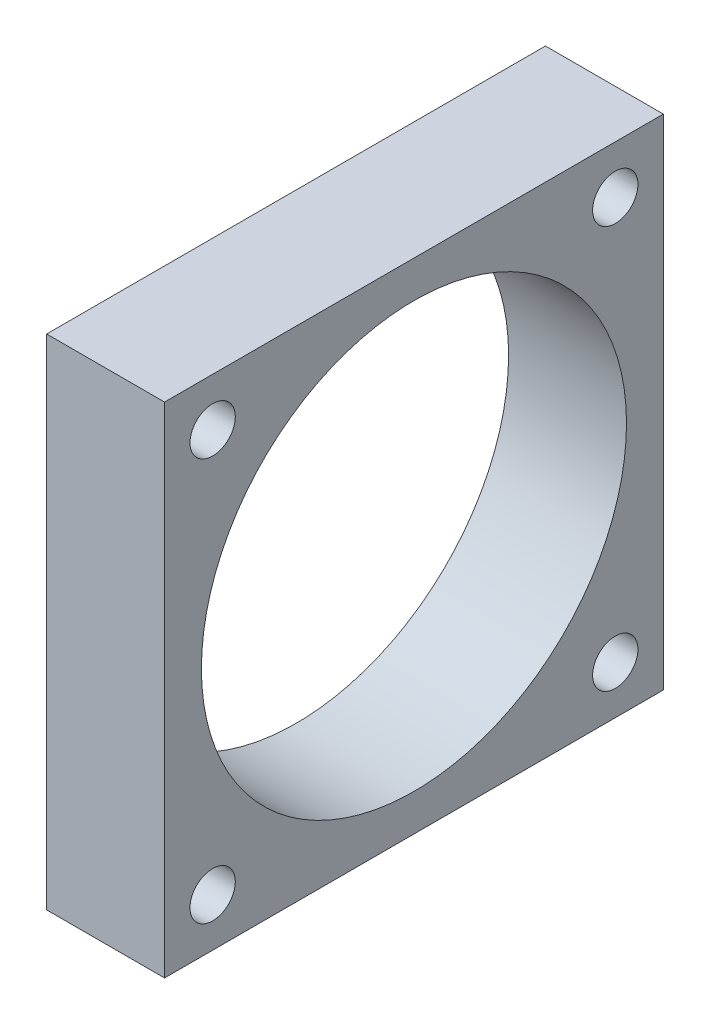
ISO-10303-21;
HEADER;
FILE_DESCRIPTION(('STEP AP214'),'2;1');
FILE_NAME('part.step','',(''),(''),'','','');
FILE_SCHEMA(('AUTOMOTIVE_DESIGN { 1 0 10303 214 1 1 1 1 }'));
ENDSEC;
DATA;
#1=APPLICATION_CONTEXT('core data for automotive mechanical design processes');
#2=APPLICATION_PROTOCOL_DEFINITION('international standard','automotive_design',2000,#1);
#3=PRODUCT_CONTEXT('',#1,'mechanical');
#4=PRODUCT('Part','Part','',(#3));
#5=PRODUCT_RELATED_PRODUCT_CATEGORY('part','',(#4));
#6=PRODUCT_DEFINITION_FORMATION('','',#4);
#7=PRODUCT_DEFINITION_CONTEXT('part definition',#1,'design');
#8=PRODUCT_DEFINITION('design','',#6,#7);
#9=PRODUCT_DEFINITION_SHAPE('','',#8);
#10=(LENGTH_UNIT() NAMED_UNIT(*) SI_UNIT(.MILLI.,.METRE.));
#11=(NAMED_UNIT(*) PLANE_ANGLE_UNIT() SI_UNIT($,.RADIAN.));
#12=(NAMED_UNIT(*) SI_UNIT($,.STERADIAN.) SOLID_ANGLE_UNIT());
#13=UNCERTAINTY_MEASURE_WITH_UNIT(LENGTH_MEASURE(1.E-05),#10,'distance_accuracy_value','');
#14=(GEOMETRIC_REPRESENTATION_CONTEXT(3) GLOBAL_UNCERTAINTY_ASSIGNED_CONTEXT((#13)) GLOBAL_UNIT_ASSIGNED_CONTEXT((#10,
#11,#12)) REPRESENTATION_CONTEXT('',''));
#15=CARTESIAN_POINT('',(0.,0.,0.));
#16=DIRECTION('',(0.,0.,1.));
#17=DIRECTION('',(1.,0.,0.));
#18=AXIS2_PLACEMENT_3D('',#15,#16,#17);
#19=CARTESIAN_POINT('',(13.208,0.,0.));
#20=DIRECTION('',(1.,0.,0.));
#21=DIRECTION('',(0.,0.,-1.));
#22=AXIS2_PLACEMENT_3D('',#19,#20,#21);
#23=PLANE('',#22);
#24=CARTESIAN_POINT('',(13.208,-22.5518463273584,-22.5518463273586));
#25=DIRECTION('',(1.,0.,0.));
#26=DIRECTION('',(0.,0.,-1.));
#27=AXIS2_PLACEMENT_3D('',#24,#25,#26);
#28=CIRCLE('',#27,2.54);
#29=CARTESIAN_POINT('',(13.208,-22.5518463273584,-25.0918463273586));
#30=VERTEX_POINT('',#29);
#31=EDGE_CURVE('E133',#30,#30,#28,.T.);
#32=ORIENTED_EDGE('',*,*,#31,.F.);
#33=EDGE_LOOP('',(#32));
#34=FACE_BOUND('',#33,.T.);
#35=CARTESIAN_POINT('',(13.208,22.5518463273586,-22.5518463273584));
#36=DIRECTION('',(1.,0.,0.));
#37=DIRECTION('',(0.,0.,-1.));
#38=AXIS2_PLACEMENT_3D('',#35,#36,#37);
#39=CIRCLE('',#38,2.54);
#40=CARTESIAN_POINT('',(13.208,22.5518463273586,-25.0918463273584));
#41=VERTEX_POINT('',#40);
#42=EDGE_CURVE('E136',#41,#41,#39,.T.);
#43=ORIENTED_EDGE('',*,*,#42,.F.);
#44=EDGE_LOOP('',(#43));
#45=FACE_BOUND('',#44,.T.);
#46=CARTESIAN_POINT('',(13.208,22.5518463273584,22.5518463273586));
#47=DIRECTION('',(1.,0.,0.));
#48=DIRECTION('',(0.,0.,-1.));
#49=AXIS2_PLACEMENT_3D('',#46,#47,#48);
#50=CIRCLE('',#49,2.54);
#51=CARTESIAN_POINT('',(13.208,22.5518463273584,20.0118463273586));
#52=VERTEX_POINT('',#51);
#53=EDGE_CURVE('E132',#52,#52,#50,.T.);
#54=ORIENTED_EDGE('',*,*,#53,.F.);
#55=EDGE_LOOP('',(#54));
#56=FACE_BOUND('',#55,.T.);
#57=CARTESIAN_POINT('',(13.208,-22.5518463273586,22.5518463273584));
#58=DIRECTION('',(1.,0.,0.));
#59=DIRECTION('',(0.,0.,-1.));
#60=AXIS2_PLACEMENT_3D('',#57,#58,#59);
#61=CIRCLE('',#60,2.54);
#62=CARTESIAN_POINT('',(13.208,-22.5518463273586,20.0118463273584));
#63=VERTEX_POINT('',#62);
#64=EDGE_CURVE('E113',#63,#63,#61,.T.);
#65=ORIENTED_EDGE('',*,*,#64,.F.);
#66=EDGE_LOOP('',(#65));
#67=FACE_BOUND('',#66,.T.);
#68=DIRECTION('',(0.,1.,0.));
#69=VECTOR('',#68,1.);
#70=CARTESIAN_POINT('',(13.208,27.94,-27.94));
#71=LINE('',#70,#69);
#72=CARTESIAN_POINT('',(13.208,-27.94,-27.94));
#73=VERTEX_POINT('',#72);
#74=CARTESIAN_POINT('',(13.208,27.94,-27.94));
#75=VERTEX_POINT('',#74);
#76=EDGE_CURVE('E87',#73,#75,#71,.T.);
#77=ORIENTED_EDGE('',*,*,#76,.T.);
#78=DIRECTION('',(0.,0.,1.));
#79=VECTOR('',#78,1.);
#80=CARTESIAN_POINT('',(13.208,27.94,27.94));
#81=LINE('',#80,#79);
#82=CARTESIAN_POINT('',(13.208,27.94,27.94));
#83=VERTEX_POINT('',#82);
#84=EDGE_CURVE('E82',#75,#83,#81,.T.);
#85=ORIENTED_EDGE('',*,*,#84,.T.);
#86=DIRECTION('',(0.,-1.,0.));
#87=VECTOR('',#86,1.);
#88=CARTESIAN_POINT('',(13.208,27.94,27.94));
#89=LINE('',#88,#87);
#90=CARTESIAN_POINT('',(13.208,-27.94,27.94));
#91=VERTEX_POINT('',#90);
#92=EDGE_CURVE('E85',#83,#91,#89,.T.);
#93=ORIENTED_EDGE('',*,*,#92,.T.);
#94=DIRECTION('',(0.,0.,-1.));
#95=VECTOR('',#94,1.);
#96=CARTESIAN_POINT('',(13.208,-27.94,27.94));
#97=LINE('',#96,#95);
#98=EDGE_CURVE('E52',#91,#73,#97,.T.);
#99=ORIENTED_EDGE('',*,*,#98,.T.);
#100=EDGE_LOOP('',(#77,#85,#93,#99));
#101=FACE_BOUND('',#100,.T.);
#102=CARTESIAN_POINT('',(13.208,0.,0.));
#103=DIRECTION('',(1.,0.,0.));
#104=DIRECTION('',(0.,0.,-1.));
#105=AXIS2_PLACEMENT_3D('',#102,#103,#104);
#106=CIRCLE('',#105,23.8125);
#107=CARTESIAN_POINT('',(13.208,0.,-23.8125));
#108=VERTEX_POINT('',#107);
#109=EDGE_CURVE('E103',#108,#108,#106,.T.);
#110=ORIENTED_EDGE('',*,*,#109,.F.);
#111=EDGE_LOOP('',(#110));
#112=FACE_BOUND('',#111,.T.);
#113=ADVANCED_FACE('F33',(#34,#45,#56,#67,#101,#112),#23,.T.);
#114=CARTESIAN_POINT('',(0.,0.,0.));
#115=DIRECTION('',(1.,0.,0.));
#116=DIRECTION('',(0.,0.,-1.));
#117=AXIS2_PLACEMENT_3D('',#114,#115,#116);
#118=PLANE('',#117);
#119=CARTESIAN_POINT('',(0.,-22.5518463273584,-22.5518463273586));
#120=DIRECTION('',(1.,0.,0.));
#121=DIRECTION('',(0.,0.,-1.));
#122=AXIS2_PLACEMENT_3D('',#119,#120,#121);
#123=CIRCLE('',#122,2.54);
#124=CARTESIAN_POINT('',(0.,-22.5518463273584,-25.0918463273586));
#125=VERTEX_POINT('',#124);
#126=EDGE_CURVE('E37',#125,#125,#123,.T.);
#127=ORIENTED_EDGE('',*,*,#126,.T.);
#128=EDGE_LOOP('',(#127));
#129=FACE_BOUND('',#128,.T.);
#130=CARTESIAN_POINT('',(0.,22.5518463273586,-22.5518463273584));
#131=DIRECTION('',(1.,0.,0.));
#132=DIRECTION('',(0.,0.,-1.));
#133=AXIS2_PLACEMENT_3D('',#130,#131,#132);
#134=CIRCLE('',#133,2.54);
#135=CARTESIAN_POINT('',(0.,22.5518463273586,-25.0918463273584));
#136=VERTEX_POINT('',#135);
#137=EDGE_CURVE('E115',#136,#136,#134,.T.);
#138=ORIENTED_EDGE('',*,*,#137,.T.);
#139=EDGE_LOOP('',(#138));
#140=FACE_BOUND('',#139,.T.);
#141=CARTESIAN_POINT('',(0.,22.5518463273584,22.5518463273586));
#142=DIRECTION('',(1.,0.,0.));
#143=DIRECTION('',(0.,0.,-1.));
#144=AXIS2_PLACEMENT_3D('',#141,#142,#143);
#145=CIRCLE('',#144,2.54);
#146=CARTESIAN_POINT('',(0.,22.5518463273584,20.0118463273586));
#147=VERTEX_POINT('',#146);
#148=EDGE_CURVE('E112',#147,#147,#145,.T.);
#149=ORIENTED_EDGE('',*,*,#148,.T.);
#150=EDGE_LOOP('',(#149));
#151=FACE_BOUND('',#150,.T.);
#152=CARTESIAN_POINT('',(0.,-22.5518463273586,22.5518463273584));
#153=DIRECTION('',(1.,0.,0.));
#154=DIRECTION('',(0.,0.,-1.));
#155=AXIS2_PLACEMENT_3D('',#152,#153,#154);
#156=CIRCLE('',#155,2.54);
#157=CARTESIAN_POINT('',(0.,-22.5518463273586,20.0118463273584));
#158=VERTEX_POINT('',#157);
#159=EDGE_CURVE('E109',#158,#158,#156,.T.);
#160=ORIENTED_EDGE('',*,*,#159,.T.);
#161=EDGE_LOOP('',(#160));
#162=FACE_BOUND('',#161,.T.);
#163=DIRECTION('',(0.,1.,0.));
#164=VECTOR('',#163,1.);
#165=CARTESIAN_POINT('',(0.,27.94,-27.94));
#166=LINE('',#165,#164);
#167=CARTESIAN_POINT('',(0.,-27.94,-27.94));
#168=VERTEX_POINT('',#167);
#169=CARTESIAN_POINT('',(0.,27.94,-27.94));
#170=VERTEX_POINT('',#169);
#171=EDGE_CURVE('E100',#168,#170,#166,.T.);
#172=ORIENTED_EDGE('',*,*,#171,.F.);
#173=DIRECTION('',(0.,0.,-1.));
#174=VECTOR('',#173,1.);
#175=CARTESIAN_POINT('',(0.,-27.94,27.94));
#176=LINE('',#175,#174);
#177=CARTESIAN_POINT('',(0.,-27.94,27.94));
#178=VERTEX_POINT('',#177);
#179=EDGE_CURVE('E75',#178,#168,#176,.T.);
#180=ORIENTED_EDGE('',*,*,#179,.F.);
#181=DIRECTION('',(0.,-1.,0.));
#182=VECTOR('',#181,1.);
#183=CARTESIAN_POINT('',(0.,27.94,27.94));
#184=LINE('',#183,#182);
#185=CARTESIAN_POINT('',(0.,27.94,27.94));
#186=VERTEX_POINT('',#185);
#187=EDGE_CURVE('E69',#186,#178,#184,.T.);
#188=ORIENTED_EDGE('',*,*,#187,.F.);
#189=DIRECTION('',(0.,0.,1.));
#190=VECTOR('',#189,1.);
#191=CARTESIAN_POINT('',(0.,27.94,27.94));
#192=LINE('',#191,#190);
#193=EDGE_CURVE('E91',#170,#186,#192,.T.);
#194=ORIENTED_EDGE('',*,*,#193,.F.);
#195=EDGE_LOOP('',(#172,#180,#188,#194));
#196=FACE_BOUND('',#195,.T.);
#197=CARTESIAN_POINT('',(0.,0.,0.));
#198=DIRECTION('',(1.,0.,0.));
#199=DIRECTION('',(0.,0.,-1.));
#200=AXIS2_PLACEMENT_3D('',#197,#198,#199);
#201=CIRCLE('',#200,23.8125);
#202=CARTESIAN_POINT('',(0.,0.,-23.8125));
#203=VERTEX_POINT('',#202);
#204=EDGE_CURVE('E120',#203,#203,#201,.T.);
#205=ORIENTED_EDGE('',*,*,#204,.T.);
#206=EDGE_LOOP('',(#205));
#207=FACE_BOUND('',#206,.T.);
#208=ADVANCED_FACE('F147',(#129,#140,#151,#162,#196,#207),#118,.F.);
#209=CARTESIAN_POINT('',(13.208,27.94,-27.94));
#210=DIRECTION('',(0.,0.,1.));
#211=DIRECTION('',(0.,-1.,0.));
#212=AXIS2_PLACEMENT_3D('',#209,#210,#211);
#213=PLANE('',#212);
#214=ORIENTED_EDGE('',*,*,#171,.T.);
#215=DIRECTION('',(-1.,0.,0.));
#216=VECTOR('',#215,1.);
#217=CARTESIAN_POINT('',(13.208,27.94,-27.94));
#218=LINE('',#217,#216);
#219=EDGE_CURVE('E11',#75,#170,#218,.T.);
#220=ORIENTED_EDGE('',*,*,#219,.F.);
#221=ORIENTED_EDGE('',*,*,#76,.F.);
#222=DIRECTION('',(-1.,0.,0.));
#223=VECTOR('',#222,1.);
#224=CARTESIAN_POINT('',(13.208,-27.94,-27.94));
#225=LINE('',#224,#223);
#226=EDGE_CURVE('E96',#73,#168,#225,.T.);
#227=ORIENTED_EDGE('',*,*,#226,.T.);
#228=EDGE_LOOP('',(#214,#220,#221,#227));
#229=FACE_BOUND('',#228,.T.);
#230=ADVANCED_FACE('F35',(#229),#213,.F.);
#231=CARTESIAN_POINT('',(13.208,27.94,27.94));
#232=DIRECTION('',(0.,-1.,0.));
#233=DIRECTION('',(0.,0.,-1.));
#234=AXIS2_PLACEMENT_3D('',#231,#232,#233);
#235=PLANE('',#234);
#236=ORIENTED_EDGE('',*,*,#193,.T.);
#237=DIRECTION('',(-1.,0.,0.));
#238=VECTOR('',#237,1.);
#239=CARTESIAN_POINT('',(13.208,27.94,27.94));
#240=LINE('',#239,#238);
#241=EDGE_CURVE('E43',#83,#186,#240,.T.);
#242=ORIENTED_EDGE('',*,*,#241,.F.);
#243=ORIENTED_EDGE('',*,*,#84,.F.);
#244=ORIENTED_EDGE('',*,*,#219,.T.);
#245=EDGE_LOOP('',(#236,#242,#243,#244));
#246=FACE_BOUND('',#245,.T.);
#247=ADVANCED_FACE('F90',(#246),#235,.F.);
#248=CARTESIAN_POINT('',(13.208,27.94,27.94));
#249=DIRECTION('',(0.,0.,-1.));
#250=DIRECTION('',(0.,1.,0.));
#251=AXIS2_PLACEMENT_3D('',#248,#249,#250);
#252=PLANE('',#251);
#253=ORIENTED_EDGE('',*,*,#187,.T.);
#254=DIRECTION('',(-1.,0.,0.));
#255=VECTOR('',#254,1.);
#256=CARTESIAN_POINT('',(13.208,-27.94,27.94));
#257=LINE('',#256,#255);
#258=EDGE_CURVE('E92',#91,#178,#257,.T.);
#259=ORIENTED_EDGE('',*,*,#258,.F.);
#260=ORIENTED_EDGE('',*,*,#92,.F.);
#261=ORIENTED_EDGE('',*,*,#241,.T.);
#262=EDGE_LOOP('',(#253,#259,#260,#261));
#263=FACE_BOUND('',#262,.T.);
#264=ADVANCED_FACE('F94',(#263),#252,.F.);
#265=CARTESIAN_POINT('',(13.208,-27.94,27.94));
#266=DIRECTION('',(0.,1.,0.));
#267=DIRECTION('',(0.,0.,1.));
#268=AXIS2_PLACEMENT_3D('',#265,#266,#267);
#269=PLANE('',#268);
#270=ORIENTED_EDGE('',*,*,#179,.T.);
#271=ORIENTED_EDGE('',*,*,#226,.F.);
#272=ORIENTED_EDGE('',*,*,#98,.F.);
#273=ORIENTED_EDGE('',*,*,#258,.T.);
#274=EDGE_LOOP('',(#270,#271,#272,#273));
#275=FACE_BOUND('',#274,.T.);
#276=ADVANCED_FACE('F164',(#275),#269,.F.);
#277=CARTESIAN_POINT('',(13.208,0.,0.));
#278=DIRECTION('',(-1.,0.,0.));
#279=DIRECTION('',(0.,0.,1.));
#280=AXIS2_PLACEMENT_3D('',#277,#278,#279);
#281=CYLINDRICAL_SURFACE('',#280,23.8125);
#282=ORIENTED_EDGE('',*,*,#109,.T.);
#283=EDGE_LOOP('',(#282));
#284=FACE_BOUND('',#283,.T.);
#285=ORIENTED_EDGE('',*,*,#204,.F.);
#286=EDGE_LOOP('',(#285));
#287=FACE_BOUND('',#286,.T.);
#288=ADVANCED_FACE('F155',(#284,#287),#281,.F.);
#289=CARTESIAN_POINT('',(-1.2E-05,-22.5518463273586,22.5518463273584));
#290=DIRECTION('',(1.,0.,0.));
#291=DIRECTION('',(0.,0.,-1.));
#292=AXIS2_PLACEMENT_3D('',#289,#290,#291);
#293=CYLINDRICAL_SURFACE('',#292,2.54);
#294=ORIENTED_EDGE('',*,*,#64,.T.);
#295=EDGE_LOOP('',(#294));
#296=FACE_BOUND('',#295,.T.);
#297=ORIENTED_EDGE('',*,*,#159,.F.);
#298=EDGE_LOOP('',(#297));
#299=FACE_BOUND('',#298,.T.);
#300=ADVANCED_FACE('F152',(#296,#299),#293,.F.);
#301=CARTESIAN_POINT('',(-1.2E-05,22.5518463273584,22.5518463273586));
#302=DIRECTION('',(1.,0.,0.));
#303=DIRECTION('',(0.,0.,-1.));
#304=AXIS2_PLACEMENT_3D('',#301,#302,#303);
#305=CYLINDRICAL_SURFACE('',#304,2.54);
#306=ORIENTED_EDGE('',*,*,#53,.T.);
#307=EDGE_LOOP('',(#306));
#308=FACE_BOUND('',#307,.T.);
#309=ORIENTED_EDGE('',*,*,#148,.F.);
#310=EDGE_LOOP('',(#309));
#311=FACE_BOUND('',#310,.T.);
#312=ADVANCED_FACE('F142',(#308,#311),#305,.F.);
#313=CARTESIAN_POINT('',(-1.2E-05,22.5518463273586,-22.5518463273584));
#314=DIRECTION('',(1.,0.,0.));
#315=DIRECTION('',(0.,0.,-1.));
#316=AXIS2_PLACEMENT_3D('',#313,#314,#315);
#317=CYLINDRICAL_SURFACE('',#316,2.54);
#318=ORIENTED_EDGE('',*,*,#42,.T.);
#319=EDGE_LOOP('',(#318));
#320=FACE_BOUND('',#319,.T.);
#321=ORIENTED_EDGE('',*,*,#137,.F.);
#322=EDGE_LOOP('',(#321));
#323=FACE_BOUND('',#322,.T.);
#324=ADVANCED_FACE('F224',(#320,#323),#317,.F.);
#325=CARTESIAN_POINT('',(-1.2E-05,-22.5518463273584,-22.5518463273586));
#326=DIRECTION('',(1.,0.,0.));
#327=DIRECTION('',(0.,0.,-1.));
#328=AXIS2_PLACEMENT_3D('',#325,#326,#327);
#329=CYLINDRICAL_SURFACE('',#328,2.54);
#330=ORIENTED_EDGE('',*,*,#31,.T.);
#331=EDGE_LOOP('',(#330));
#332=FACE_BOUND('',#331,.T.);
#333=ORIENTED_EDGE('',*,*,#126,.F.);
#334=EDGE_LOOP('',(#333));
#335=FACE_BOUND('',#334,.T.);
#336=ADVANCED_FACE('F231',(#332,#335),#329,.F.);
#337=CLOSED_SHELL('',(#113,#208,#230,#247,#264,#276,#288,#300,#312,#324,#336));
#338=MANIFOLD_SOLID_BREP('B2',#337);
#339=ADVANCED_BREP_SHAPE_REPRESENTATION('',(#18,#338),#14);
#340=SHAPE_DEFINITION_REPRESENTATION(#9,#339);
ENDSEC;
END-ISO-10303-21;
